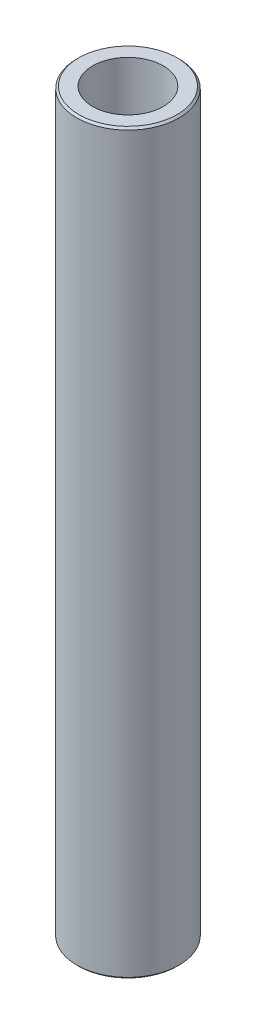
ISO-10303-21;
HEADER;
FILE_DESCRIPTION(('STEP AP214'),'2;1');
FILE_NAME('part.step','',(''),(''),'','','');
FILE_SCHEMA(('AUTOMOTIVE_DESIGN { 1 0 10303 214 1 1 1 1 }'));
ENDSEC;
DATA;
#1=APPLICATION_CONTEXT('core data for automotive mechanical design processes');
#2=APPLICATION_PROTOCOL_DEFINITION('international standard','automotive_design',2000,#1);
#3=PRODUCT_CONTEXT('',#1,'mechanical');
#4=PRODUCT('Part','Part','',(#3));
#5=PRODUCT_RELATED_PRODUCT_CATEGORY('part','',(#4));
#6=PRODUCT_DEFINITION_FORMATION('','',#4);
#7=PRODUCT_DEFINITION_CONTEXT('part definition',#1,'design');
#8=PRODUCT_DEFINITION('design','',#6,#7);
#9=PRODUCT_DEFINITION_SHAPE('','',#8);
#10=(LENGTH_UNIT() NAMED_UNIT(*) SI_UNIT(.MILLI.,.METRE.));
#11=(NAMED_UNIT(*) PLANE_ANGLE_UNIT() SI_UNIT($,.RADIAN.));
#12=(NAMED_UNIT(*) SI_UNIT($,.STERADIAN.) SOLID_ANGLE_UNIT());
#13=UNCERTAINTY_MEASURE_WITH_UNIT(LENGTH_MEASURE(1.E-05),#10,'distance_accuracy_value','');
#14=(GEOMETRIC_REPRESENTATION_CONTEXT(3) GLOBAL_UNCERTAINTY_ASSIGNED_CONTEXT((#13)) GLOBAL_UNIT_ASSIGNED_CONTEXT((#10,
#11,#12)) REPRESENTATION_CONTEXT('',''));
#15=CARTESIAN_POINT('',(0.,0.,0.));
#16=DIRECTION('',(0.,0.,1.));
#17=DIRECTION('',(1.,0.,0.));
#18=AXIS2_PLACEMENT_3D('',#15,#16,#17);
#19=CARTESIAN_POINT('',(0.,324.558327515998,0.));
#20=DIRECTION('',(0.,-1.,0.));
#21=DIRECTION('',(0.,0.,-1.));
#22=AXIS2_PLACEMENT_3D('',#19,#20,#21);
#23=CYLINDRICAL_SURFACE('',#22,22.5);
#24=CARTESIAN_POINT('',(0.,323.705356534519,0.));
#25=DIRECTION('',(0.,1.,0.));
#26=DIRECTION('',(0.,0.,1.));
#27=AXIS2_PLACEMENT_3D('',#24,#25,#26);
#28=CIRCLE('',#27,22.5);
#29=CARTESIAN_POINT('',(0.,323.705356534519,22.5));
#30=VERTEX_POINT('',#29);
#31=EDGE_CURVE('E50',#30,#30,#28,.F.);
#32=ORIENTED_EDGE('',*,*,#31,.T.);
#33=EDGE_LOOP('',(#32));
#34=FACE_BOUND('',#33,.T.);
#35=CARTESIAN_POINT('',(0.,0.852970981478574,0.));
#36=DIRECTION('',(0.,1.,0.));
#37=DIRECTION('',(0.,0.,1.));
#38=AXIS2_PLACEMENT_3D('',#35,#36,#37);
#39=CIRCLE('',#38,22.5);
#40=CARTESIAN_POINT('',(0.,0.852970981478574,22.5));
#41=VERTEX_POINT('',#40);
#42=EDGE_CURVE('E51',#41,#41,#39,.T.);
#43=ORIENTED_EDGE('',*,*,#42,.T.);
#44=EDGE_LOOP('',(#43));
#45=FACE_BOUND('',#44,.T.);
#46=ADVANCED_FACE('F39',(#34,#45),#23,.T.);
#47=CARTESIAN_POINT('',(0.,324.558327515998,0.));
#48=DIRECTION('',(0.,1.,0.));
#49=DIRECTION('',(0.,0.,1.));
#50=AXIS2_PLACEMENT_3D('',#47,#48,#49);
#51=PLANE('',#50);
#52=CARTESIAN_POINT('',(0.,324.558327515998,0.));
#53=DIRECTION('',(0.,1.,0.));
#54=DIRECTION('',(0.,0.,1.));
#55=AXIS2_PLACEMENT_3D('',#52,#53,#54);
#56=CIRCLE('',#55,21.6470290185214);
#57=CARTESIAN_POINT('',(0.,324.558327515998,21.6470290185214));
#58=VERTEX_POINT('',#57);
#59=EDGE_CURVE('E54',#58,#58,#56,.T.);
#60=ORIENTED_EDGE('',*,*,#59,.T.);
#61=EDGE_LOOP('',(#60));
#62=FACE_BOUND('',#61,.T.);
#63=CARTESIAN_POINT('',(0.,324.558327515998,0.));
#64=DIRECTION('',(0.,1.,0.));
#65=DIRECTION('',(0.,0.,1.));
#66=AXIS2_PLACEMENT_3D('',#63,#64,#65);
#67=CIRCLE('',#66,15.5346330547549);
#68=CARTESIAN_POINT('',(0.,324.558327515998,15.5346330547549));
#69=VERTEX_POINT('',#68);
#70=EDGE_CURVE('E58',#69,#69,#67,.T.);
#71=ORIENTED_EDGE('',*,*,#70,.F.);
#72=EDGE_LOOP('',(#71));
#73=FACE_BOUND('',#72,.T.);
#74=ADVANCED_FACE('F69',(#62,#73),#51,.T.);
#75=CARTESIAN_POINT('',(0.,0.,0.));
#76=DIRECTION('',(0.,1.,0.));
#77=DIRECTION('',(0.,0.,1.));
#78=AXIS2_PLACEMENT_3D('',#75,#76,#77);
#79=PLANE('',#78);
#80=CARTESIAN_POINT('',(0.,0.,0.));
#81=DIRECTION('',(0.,1.,0.));
#82=DIRECTION('',(0.,0.,1.));
#83=AXIS2_PLACEMENT_3D('',#80,#81,#82);
#84=CIRCLE('',#83,21.6470290185214);
#85=CARTESIAN_POINT('',(0.,0.,21.6470290185214));
#86=VERTEX_POINT('',#85);
#87=EDGE_CURVE('E10',#86,#86,#84,.F.);
#88=ORIENTED_EDGE('',*,*,#87,.T.);
#89=EDGE_LOOP('',(#88));
#90=FACE_BOUND('',#89,.T.);
#91=CARTESIAN_POINT('',(0.,0.,0.));
#92=DIRECTION('',(0.,1.,0.));
#93=DIRECTION('',(0.,0.,1.));
#94=AXIS2_PLACEMENT_3D('',#91,#92,#93);
#95=CIRCLE('',#94,15.5346330547549);
#96=CARTESIAN_POINT('',(0.,0.,15.5346330547549));
#97=VERTEX_POINT('',#96);
#98=EDGE_CURVE('E63',#97,#97,#95,.T.);
#99=ORIENTED_EDGE('',*,*,#98,.T.);
#100=EDGE_LOOP('',(#99));
#101=FACE_BOUND('',#100,.T.);
#102=ADVANCED_FACE('F75',(#90,#101),#79,.F.);
#103=CARTESIAN_POINT('',(0.,324.558327515998,0.));
#104=DIRECTION('',(0.,-1.,0.));
#105=DIRECTION('',(0.,0.,-1.));
#106=AXIS2_PLACEMENT_3D('',#103,#104,#105);
#107=CYLINDRICAL_SURFACE('',#106,15.5346330547549);
#108=ORIENTED_EDGE('',*,*,#70,.T.);
#109=EDGE_LOOP('',(#108));
#110=FACE_BOUND('',#109,.T.);
#111=ORIENTED_EDGE('',*,*,#98,.F.);
#112=EDGE_LOOP('',(#111));
#113=FACE_BOUND('',#112,.T.);
#114=ADVANCED_FACE('F70',(#110,#113),#107,.F.);
#115=CARTESIAN_POINT('',(0.,324.558327515998,0.));
#116=DIRECTION('',(0.,-1.,0.));
#117=DIRECTION('',(0.,0.,-1.));
#118=AXIS2_PLACEMENT_3D('',#115,#116,#117);
#119=CONICAL_SURFACE('',#118,21.6470290185214,0.785398163397454);
#120=ORIENTED_EDGE('',*,*,#31,.F.);
#121=EDGE_LOOP('',(#120));
#122=FACE_BOUND('',#121,.T.);
#123=ORIENTED_EDGE('',*,*,#59,.F.);
#124=EDGE_LOOP('',(#123));
#125=FACE_BOUND('',#124,.T.);
#126=ADVANCED_FACE('F81',(#122,#125),#119,.T.);
#127=CARTESIAN_POINT('',(0.,0.852970981478574,0.));
#128=DIRECTION('',(0.,1.,0.));
#129=DIRECTION('',(0.,0.,1.));
#130=AXIS2_PLACEMENT_3D('',#127,#128,#129);
#131=CONICAL_SURFACE('',#130,22.5,0.785398163397473);
#132=ORIENTED_EDGE('',*,*,#87,.F.);
#133=EDGE_LOOP('',(#132));
#134=FACE_BOUND('',#133,.T.);
#135=ORIENTED_EDGE('',*,*,#42,.F.);
#136=EDGE_LOOP('',(#135));
#137=FACE_BOUND('',#136,.T.);
#138=ADVANCED_FACE('F45',(#134,#137),#131,.T.);
#139=CLOSED_SHELL('',(#46,#74,#102,#114,#126,#138));
#140=MANIFOLD_SOLID_BREP('B2',#139);
#141=ADVANCED_BREP_SHAPE_REPRESENTATION('',(#18,#140),#14);
#142=SHAPE_DEFINITION_REPRESENTATION(#9,#141);
ENDSEC;
END-ISO-10303-21;
